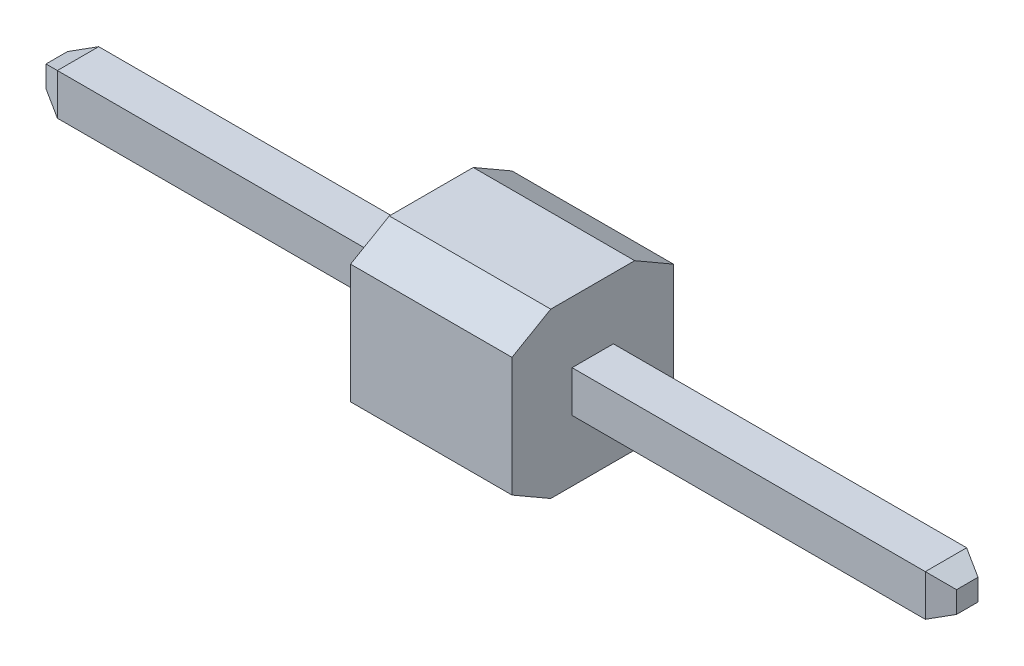
ISO-10303-21;
HEADER;
FILE_DESCRIPTION(('STEP AP214'),'2;1');
FILE_NAME('part.step','',(''),(''),'','','');
FILE_SCHEMA(('AUTOMOTIVE_DESIGN { 1 0 10303 214 1 1 1 1 }'));
ENDSEC;
DATA;
#1=APPLICATION_CONTEXT('core data for automotive mechanical design processes');
#2=APPLICATION_PROTOCOL_DEFINITION('international standard','automotive_design',2000,#1);
#3=PRODUCT_CONTEXT('',#1,'mechanical');
#4=PRODUCT('Part','Part','',(#3));
#5=PRODUCT_RELATED_PRODUCT_CATEGORY('part','',(#4));
#6=PRODUCT_DEFINITION_FORMATION('','',#4);
#7=PRODUCT_DEFINITION_CONTEXT('part definition',#1,'design');
#8=PRODUCT_DEFINITION('design','',#6,#7);
#9=PRODUCT_DEFINITION_SHAPE('','',#8);
#10=(LENGTH_UNIT() NAMED_UNIT(*) SI_UNIT(.MILLI.,.METRE.));
#11=(NAMED_UNIT(*) PLANE_ANGLE_UNIT() SI_UNIT($,.RADIAN.));
#12=(NAMED_UNIT(*) SI_UNIT($,.STERADIAN.) SOLID_ANGLE_UNIT());
#13=UNCERTAINTY_MEASURE_WITH_UNIT(LENGTH_MEASURE(1.E-05),#10,'distance_accuracy_value','');
#14=(GEOMETRIC_REPRESENTATION_CONTEXT(3) GLOBAL_UNCERTAINTY_ASSIGNED_CONTEXT((#13)) GLOBAL_UNIT_ASSIGNED_CONTEXT((#10,
#11,#12)) REPRESENTATION_CONTEXT('',''));
#15=CARTESIAN_POINT('',(0.,0.,0.));
#16=DIRECTION('',(0.,0.,1.));
#17=DIRECTION('',(1.,0.,0.));
#18=AXIS2_PLACEMENT_3D('',#15,#16,#17);
#19=CARTESIAN_POINT('',(5.4211019617172,15.5571157260571,-2.77112192788788));
#20=DIRECTION('',(1.,-9.93476518829084E-08,4.37113882867379E-08));
#21=DIRECTION('',(-9.93476589883358E-08,-1.,8.74227765734759E-08));
#22=AXIS2_PLACEMENT_3D('',#19,#20,#21);
#23=PLANE('',#22);
#24=DIRECTION('',(-1.18186632779336E-08,-0.500000075710541,-0.866025360072933));
#25=VECTOR('',#24,1.);
#26=CARTESIAN_POINT('',(5.42110176954259,14.3135260248209,-1.2011218191698));
#27=LINE('',#26,#25);
#28=CARTESIAN_POINT('',(5.42110176954259,14.3135260248209,-1.2011218191698));
#29=VERTEX_POINT('',#28);
#30=CARTESIAN_POINT('',(5.42110176135438,13.9671158108572,-1.80112178888567));
#31=VERTEX_POINT('',#30);
#32=EDGE_CURVE('E11',#29,#31,#27,.T.);
#33=ORIENTED_EDGE('',*,*,#32,.T.);
#34=DIRECTION('',(4.37113811813104E-08,-8.74227842254741E-08,-0.999999999999995));
#35=VECTOR('',#34,1.);
#36=CARTESIAN_POINT('',(5.42110176135438,13.9671158108572,-1.80112178888567));
#37=LINE('',#36,#35);
#38=CARTESIAN_POINT('',(5.42110181817917,13.9671156972076,-3.10112178888567));
#39=VERTEX_POINT('',#38);
#40=EDGE_CURVE('E304',#31,#39,#37,.T.);
#41=ORIENTED_EDGE('',*,*,#40,.T.);
#42=DIRECTION('',(8.75289963531795E-08,0.499999924289839,-0.866025447495711));
#43=VECTOR('',#42,1.);
#44=CARTESIAN_POINT('',(5.42110181817917,13.9671156972076,-3.10112178888567));
#45=LINE('',#44,#43);
#46=CARTESIAN_POINT('',(5.42110187882104,14.313525806264,-3.7011218191698));
#47=VERTEX_POINT('',#46);
#48=EDGE_CURVE('E296',#39,#47,#45,.T.);
#49=ORIENTED_EDGE('',*,*,#48,.T.);
#50=DIRECTION('',(9.93476588436476E-08,0.999999999999991,-8.74227767226933E-08));
#51=VECTOR('',#50,1.);
#52=CARTESIAN_POINT('',(5.42110187882104,14.313525806264,-3.7011218191698));
#53=LINE('',#52,#51);
#54=CARTESIAN_POINT('',(5.42110206233402,16.160705483234,-3.70112198065538));
#55=VERTEX_POINT('',#54);
#56=EDGE_CURVE('E281',#47,#55,#53,.T.);
#57=ORIENTED_EDGE('',*,*,#56,.T.);
#58=DIRECTION('',(-1.18186619958731E-08,-0.500000075710537,-0.866025360072935));
#59=VECTOR('',#58,1.);
#60=CARTESIAN_POINT('',(5.42110207052223,16.5071156972076,-3.10112201093952));
#61=LINE('',#60,#59);
#62=CARTESIAN_POINT('',(5.42110207052223,16.5071156972076,-3.10112201093952));
#63=VERTEX_POINT('',#62);
#64=EDGE_CURVE('E265',#63,#55,#61,.T.);
#65=ORIENTED_EDGE('',*,*,#64,.F.);
#66=DIRECTION('',(4.37113811813104E-08,-8.74227842254741E-08,-0.999999999999995));
#67=VECTOR('',#66,1.);
#68=CARTESIAN_POINT('',(5.42110201369743,16.5071158108572,-1.80112201093952));
#69=LINE('',#68,#67);
#70=CARTESIAN_POINT('',(5.42110201369743,16.5071158108572,-1.80112201093952));
#71=VERTEX_POINT('',#70);
#72=EDGE_CURVE('E248',#71,#63,#69,.T.);
#73=ORIENTED_EDGE('',*,*,#72,.F.);
#74=DIRECTION('',(8.7528996352548E-08,0.499999924289832,-0.866025447495716));
#75=VECTOR('',#74,1.);
#76=CARTESIAN_POINT('',(5.42110195305556,16.1607057017909,-1.20112198065538));
#77=LINE('',#76,#75);
#78=CARTESIAN_POINT('',(5.42110195305556,16.1607057017909,-1.20112198065538));
#79=VERTEX_POINT('',#78);
#80=EDGE_CURVE('E242',#79,#71,#77,.T.);
#81=ORIENTED_EDGE('',*,*,#80,.F.);
#82=DIRECTION('',(9.93476588436476E-08,0.999999999999991,-8.74227762418639E-08));
#83=VECTOR('',#82,1.);
#84=CARTESIAN_POINT('',(5.42110176954259,14.3135260248209,-1.2011218191698));
#85=LINE('',#84,#83);
#86=EDGE_CURVE('E236',#29,#79,#85,.T.);
#87=ORIENTED_EDGE('',*,*,#86,.F.);
#88=EDGE_LOOP('',(#33,#41,#49,#57,#65,#73,#81,#87));
#89=FACE_BOUND('',#88,.T.);
#90=DIRECTION('',(-4.37113817364219E-08,8.74227856773042E-08,0.999999999999995));
#91=VECTOR('',#90,1.);
#92=CARTESIAN_POINT('',(5.42110189813469,14.9171157260571,-2.7711218719373));
#93=LINE('',#92,#91);
#94=CARTESIAN_POINT('',(5.42110189813469,14.9171157260571,-2.7711218719373));
#95=VERTEX_POINT('',#94);
#96=CARTESIAN_POINT('',(5.42110187015941,14.9171157820077,-2.1311218719373));
#97=VERTEX_POINT('',#96);
#98=EDGE_CURVE('E302',#95,#97,#93,.T.);
#99=ORIENTED_EDGE('',*,*,#98,.T.);
#100=DIRECTION('',(-9.93476592658906E-08,-0.999999999999991,8.74227766567418E-08));
#101=VECTOR('',#100,1.);
#102=CARTESIAN_POINT('',(5.42110193374191,15.5571157820077,-2.13112192788788));
#103=LINE('',#102,#101);
#104=CARTESIAN_POINT('',(5.42110193374191,15.5571157820077,-2.13112192788788));
#105=VERTEX_POINT('',#104);
#106=EDGE_CURVE('E293',#105,#97,#103,.T.);
#107=ORIENTED_EDGE('',*,*,#106,.F.);
#108=DIRECTION('',(-4.37113817364219E-08,8.74227912284194E-08,0.999999999999995));
#109=VECTOR('',#108,1.);
#110=CARTESIAN_POINT('',(5.4211019617172,15.5571157260571,-2.77112192788788));
#111=LINE('',#110,#109);
#112=CARTESIAN_POINT('',(5.4211019617172,15.5571157260571,-2.77112192788788));
#113=VERTEX_POINT('',#112);
#114=EDGE_CURVE('E278',#113,#105,#111,.T.);
#115=ORIENTED_EDGE('',*,*,#114,.F.);
#116=DIRECTION('',(-9.93476592658906E-08,-0.999999999999991,8.74227759628524E-08));
#117=VECTOR('',#116,1.);
#118=CARTESIAN_POINT('',(5.4211019617172,15.5571157260571,-2.77112192788788));
#119=LINE('',#118,#117);
#120=EDGE_CURVE('E263',#113,#95,#119,.T.);
#121=ORIENTED_EDGE('',*,*,#120,.T.);
#122=EDGE_LOOP('',(#99,#107,#115,#121));
#123=FACE_BOUND('',#122,.T.);
#124=ADVANCED_FACE('F17',(#89,#123),#23,.T.);
#125=CARTESIAN_POINT('',(2.9211019617172,15.5571159744263,-2.77112203716635));
#126=DIRECTION('',(1.,-9.93476518829084E-08,4.37113882867379E-08));
#127=DIRECTION('',(-9.93476589883358E-08,-1.,8.74227765734759E-08));
#128=AXIS2_PLACEMENT_3D('',#125,#126,#127);
#129=PLANE('',#128);
#130=DIRECTION('',(-1.18186632779336E-08,-0.500000075710541,-0.866025360072933));
#131=VECTOR('',#130,1.);
#132=CARTESIAN_POINT('',(2.92110176954259,14.31352627319,-1.20112192844828));
#133=LINE('',#132,#131);
#134=CARTESIAN_POINT('',(2.92110176954259,14.31352627319,-1.20112192844828));
#135=VERTEX_POINT('',#134);
#136=CARTESIAN_POINT('',(2.92110176135438,13.9671160592264,-1.80112189816414));
#137=VERTEX_POINT('',#136);
#138=EDGE_CURVE('E24',#135,#137,#133,.T.);
#139=ORIENTED_EDGE('',*,*,#138,.F.);
#140=DIRECTION('',(9.93476588436476E-08,0.999999999999991,-8.74227762418639E-08));
#141=VECTOR('',#140,1.);
#142=CARTESIAN_POINT('',(2.92110176954259,14.31352627319,-1.20112192844828));
#143=LINE('',#142,#141);
#144=CARTESIAN_POINT('',(2.92110195305556,16.16070595016,-1.20112208993385));
#145=VERTEX_POINT('',#144);
#146=EDGE_CURVE('E300',#135,#145,#143,.T.);
#147=ORIENTED_EDGE('',*,*,#146,.T.);
#148=DIRECTION('',(8.7528996352548E-08,0.499999924289832,-0.866025447495716));
#149=VECTOR('',#148,1.);
#150=CARTESIAN_POINT('',(2.92110195305556,16.16070595016,-1.20112208993385));
#151=LINE('',#150,#149);
#152=CARTESIAN_POINT('',(2.92110201369743,16.5071160592264,-1.80112212021799));
#153=VERTEX_POINT('',#152);
#154=EDGE_CURVE('E286',#145,#153,#151,.T.);
#155=ORIENTED_EDGE('',*,*,#154,.T.);
#156=DIRECTION('',(4.37113811813104E-08,-8.74227842254741E-08,-0.999999999999995));
#157=VECTOR('',#156,1.);
#158=CARTESIAN_POINT('',(2.92110201369743,16.5071160592264,-1.80112212021799));
#159=LINE('',#158,#157);
#160=CARTESIAN_POINT('',(2.92110207052223,16.5071159455768,-3.10112212021799));
#161=VERTEX_POINT('',#160);
#162=EDGE_CURVE('E271',#153,#161,#159,.T.);
#163=ORIENTED_EDGE('',*,*,#162,.T.);
#164=DIRECTION('',(-1.18186626368607E-08,-0.500000075710537,-0.866025360072935));
#165=VECTOR('',#164,1.);
#166=CARTESIAN_POINT('',(2.92110207052223,16.5071159455768,-3.10112212021799));
#167=LINE('',#166,#165);
#168=CARTESIAN_POINT('',(2.92110206233402,16.1607057316031,-3.70112208993385));
#169=VERTEX_POINT('',#168);
#170=EDGE_CURVE('E253',#161,#169,#167,.T.);
#171=ORIENTED_EDGE('',*,*,#170,.T.);
#172=DIRECTION('',(9.93476588436476E-08,0.999999999999991,-8.74227767226933E-08));
#173=VECTOR('',#172,1.);
#174=CARTESIAN_POINT('',(2.92110187882104,14.3135260546331,-3.70112192844828));
#175=LINE('',#174,#173);
#176=CARTESIAN_POINT('',(2.92110187882104,14.3135260546331,-3.70112192844828));
#177=VERTEX_POINT('',#176);
#178=EDGE_CURVE('E261',#177,#169,#175,.T.);
#179=ORIENTED_EDGE('',*,*,#178,.F.);
#180=DIRECTION('',(8.75289963531795E-08,0.499999924289839,-0.866025447495711));
#181=VECTOR('',#180,1.);
#182=CARTESIAN_POINT('',(2.92110181817917,13.9671159455768,-3.10112189816414));
#183=LINE('',#182,#181);
#184=CARTESIAN_POINT('',(2.92110181817917,13.9671159455768,-3.10112189816414));
#185=VERTEX_POINT('',#184);
#186=EDGE_CURVE('E276',#185,#177,#183,.T.);
#187=ORIENTED_EDGE('',*,*,#186,.F.);
#188=DIRECTION('',(4.37113811813104E-08,-8.74227842254741E-08,-0.999999999999995));
#189=VECTOR('',#188,1.);
#190=CARTESIAN_POINT('',(2.92110176135438,13.9671160592264,-1.80112189816414));
#191=LINE('',#190,#189);
#192=EDGE_CURVE('E291',#137,#185,#191,.T.);
#193=ORIENTED_EDGE('',*,*,#192,.F.);
#194=EDGE_LOOP('',(#139,#147,#155,#163,#171,#179,#187,#193));
#195=FACE_BOUND('',#194,.T.);
#196=DIRECTION('',(-9.93476585720012E-08,-0.999999999999991,8.74227766567418E-08));
#197=VECTOR('',#196,1.);
#198=CARTESIAN_POINT('',(2.92110193374191,15.5571160303769,-2.13112203716635));
#199=LINE('',#198,#197);
#200=CARTESIAN_POINT('',(2.92110193374191,15.5571160303769,-2.13112203716635));
#201=VERTEX_POINT('',#200);
#202=CARTESIAN_POINT('',(2.92110187015941,14.9171160303769,-2.13112198121578));
#203=VERTEX_POINT('',#202);
#204=EDGE_CURVE('E298',#201,#203,#199,.T.);
#205=ORIENTED_EDGE('',*,*,#204,.T.);
#206=DIRECTION('',(-4.37113810425325E-08,8.74227856773042E-08,0.999999999999995));
#207=VECTOR('',#206,1.);
#208=CARTESIAN_POINT('',(2.92110189813469,14.9171159744263,-2.77112198121578));
#209=LINE('',#208,#207);
#210=CARTESIAN_POINT('',(2.92110189813469,14.9171159744263,-2.77112198121578));
#211=VERTEX_POINT('',#210);
#212=EDGE_CURVE('E283',#211,#203,#209,.T.);
#213=ORIENTED_EDGE('',*,*,#212,.F.);
#214=DIRECTION('',(-9.93476592658906E-08,-0.999999999999991,8.74227759628524E-08));
#215=VECTOR('',#214,1.);
#216=CARTESIAN_POINT('',(2.9211019617172,15.5571159744263,-2.77112203716635));
#217=LINE('',#216,#215);
#218=CARTESIAN_POINT('',(2.9211019617172,15.5571159744263,-2.77112203716635));
#219=VERTEX_POINT('',#218);
#220=EDGE_CURVE('E268',#219,#211,#217,.T.);
#221=ORIENTED_EDGE('',*,*,#220,.F.);
#222=DIRECTION('',(-4.37113817364219E-08,8.74227912284194E-08,0.999999999999995));
#223=VECTOR('',#222,1.);
#224=CARTESIAN_POINT('',(2.9211019617172,15.5571159744263,-2.77112203716635));
#225=LINE('',#224,#223);
#226=EDGE_CURVE('E251',#219,#201,#225,.T.);
#227=ORIENTED_EDGE('',*,*,#226,.T.);
#228=EDGE_LOOP('',(#205,#213,#221,#227));
#229=FACE_BOUND('',#228,.T.);
#230=ADVANCED_FACE('F314',(#195,#229),#129,.F.);
#231=CARTESIAN_POINT('',(5.42110176954259,14.3135260248209,-1.2011218191698));
#232=DIRECTION('',(1.07893287081065E-07,0.866025360072937,-0.500000075710535));
#233=DIRECTION('',(1.18186629566715E-08,0.500000075710542,0.866025360072941));
#234=AXIS2_PLACEMENT_3D('',#231,#232,#233);
#235=PLANE('',#234);
#236=ORIENTED_EDGE('',*,*,#138,.T.);
#237=DIRECTION('',(-0.999999999999994,9.93476490407369E-08,-4.37113882867377E-08));
#238=VECTOR('',#237,1.);
#239=CARTESIAN_POINT('',(5.42110176135438,13.9671158108572,-1.80112178888567));
#240=LINE('',#239,#238);
#241=EDGE_CURVE('E288',#31,#137,#240,.T.);
#242=ORIENTED_EDGE('',*,*,#241,.F.);
#243=ORIENTED_EDGE('',*,*,#32,.F.);
#244=DIRECTION('',(-0.999999999999994,9.93476533039933E-08,-4.3711388109102E-08));
#245=VECTOR('',#244,1.);
#246=CARTESIAN_POINT('',(5.42110176954259,14.3135260248209,-1.2011218191698));
#247=LINE('',#246,#245);
#248=EDGE_CURVE('E256',#29,#135,#247,.T.);
#249=ORIENTED_EDGE('',*,*,#248,.T.);
#250=EDGE_LOOP('',(#236,#242,#243,#249));
#251=FACE_BOUND('',#250,.T.);
#252=ADVANCED_FACE('F306',(#251),#235,.F.);
#253=CARTESIAN_POINT('',(5.42110176135438,13.9671158108572,-1.80112178888567));
#254=DIRECTION('',(9.93476589883358E-08,1.,-8.74227765734759E-08));
#255=DIRECTION('',(1.,-9.93476518829084E-08,4.37113882867379E-08));
#256=AXIS2_PLACEMENT_3D('',#253,#254,#255);
#257=PLANE('',#256);
#258=ORIENTED_EDGE('',*,*,#192,.T.);
#259=DIRECTION('',(-0.999999999999994,9.93476490407369E-08,-4.37113882867377E-08));
#260=VECTOR('',#259,1.);
#261=CARTESIAN_POINT('',(5.42110181817917,13.9671156972076,-3.10112178888567));
#262=LINE('',#261,#260);
#263=EDGE_CURVE('E273',#39,#185,#262,.T.);
#264=ORIENTED_EDGE('',*,*,#263,.F.);
#265=ORIENTED_EDGE('',*,*,#40,.F.);
#266=ORIENTED_EDGE('',*,*,#241,.T.);
#267=EDGE_LOOP('',(#258,#264,#265,#266));
#268=FACE_BOUND('',#267,.T.);
#269=ADVANCED_FACE('F311',(#268),#257,.F.);
#270=CARTESIAN_POINT('',(5.42110181817917,13.9671156972076,-3.10112178888567));
#271=DIRECTION('',(6.41819058997377E-08,0.866025447495721,0.499999924289845));
#272=DIRECTION('',(-8.7528996031702E-08,-0.499999924289838,0.866025447495717));
#273=AXIS2_PLACEMENT_3D('',#270,#271,#272);
#274=PLANE('',#273);
#275=ORIENTED_EDGE('',*,*,#186,.T.);
#276=DIRECTION('',(-0.999999999999994,9.93476533039933E-08,-4.37113884643734E-08));
#277=VECTOR('',#276,1.);
#278=CARTESIAN_POINT('',(5.42110187882104,14.313525806264,-3.7011218191698));
#279=LINE('',#278,#277);
#280=EDGE_CURVE('E258',#47,#177,#279,.T.);
#281=ORIENTED_EDGE('',*,*,#280,.F.);
#282=ORIENTED_EDGE('',*,*,#48,.F.);
#283=ORIENTED_EDGE('',*,*,#263,.T.);
#284=EDGE_LOOP('',(#275,#281,#282,#283));
#285=FACE_BOUND('',#284,.T.);
#286=ADVANCED_FACE('F319',(#285),#274,.F.);
#287=CARTESIAN_POINT('',(5.42110187882104,14.313525806264,-3.7011218191698));
#288=DIRECTION('',(-4.37113811813106E-08,8.74227836789032E-08,1.));
#289=DIRECTION('',(-1.,9.93476518829084E-08,-4.37113882867379E-08));
#290=AXIS2_PLACEMENT_3D('',#287,#288,#289);
#291=PLANE('',#290);
#292=ORIENTED_EDGE('',*,*,#178,.T.);
#293=DIRECTION('',(-0.999999999999994,9.93476533039933E-08,-4.37113882867377E-08));
#294=VECTOR('',#293,1.);
#295=CARTESIAN_POINT('',(5.42110206233402,16.160705483234,-3.70112198065538));
#296=LINE('',#295,#294);
#297=EDGE_CURVE('E245',#55,#169,#296,.T.);
#298=ORIENTED_EDGE('',*,*,#297,.F.);
#299=ORIENTED_EDGE('',*,*,#56,.F.);
#300=ORIENTED_EDGE('',*,*,#280,.T.);
#301=EDGE_LOOP('',(#292,#298,#299,#300));
#302=FACE_BOUND('',#301,.T.);
#303=ADVANCED_FACE('F326',(#302),#291,.F.);
#304=CARTESIAN_POINT('',(5.42110207052223,16.5071156972076,-3.10112201093952));
#305=DIRECTION('',(1.07893287081065E-07,0.866025360072937,-0.500000075710535));
#306=DIRECTION('',(1.18186629566715E-08,0.500000075710542,0.866025360072941));
#307=AXIS2_PLACEMENT_3D('',#304,#305,#306);
#308=PLANE('',#307);
#309=ORIENTED_EDGE('',*,*,#170,.F.);
#310=DIRECTION('',(-0.999999999999994,9.93476490407369E-08,-4.37113882867377E-08));
#311=VECTOR('',#310,1.);
#312=CARTESIAN_POINT('',(5.42110207052223,16.5071156972076,-3.10112201093952));
#313=LINE('',#312,#311);
#314=EDGE_CURVE('E239',#63,#161,#313,.T.);
#315=ORIENTED_EDGE('',*,*,#314,.F.);
#316=ORIENTED_EDGE('',*,*,#64,.T.);
#317=ORIENTED_EDGE('',*,*,#297,.T.);
#318=EDGE_LOOP('',(#309,#315,#316,#317));
#319=FACE_BOUND('',#318,.T.);
#320=ADVANCED_FACE('F329',(#319),#308,.T.);
#321=CARTESIAN_POINT('',(5.42110201369743,16.5071158108572,-1.80112201093952));
#322=DIRECTION('',(9.93476589883358E-08,1.,-8.74227765734759E-08));
#323=DIRECTION('',(1.,-9.93476518829084E-08,4.37113882867379E-08));
#324=AXIS2_PLACEMENT_3D('',#321,#322,#323);
#325=PLANE('',#324);
#326=ORIENTED_EDGE('',*,*,#162,.F.);
#327=DIRECTION('',(-0.999999999999994,9.93476490407369E-08,-4.37113883755555E-08));
#328=VECTOR('',#327,1.);
#329=CARTESIAN_POINT('',(5.42110201369743,16.5071158108572,-1.80112201093952));
#330=LINE('',#329,#328);
#331=EDGE_CURVE('E233',#71,#153,#330,.T.);
#332=ORIENTED_EDGE('',*,*,#331,.F.);
#333=ORIENTED_EDGE('',*,*,#72,.T.);
#334=ORIENTED_EDGE('',*,*,#314,.T.);
#335=EDGE_LOOP('',(#326,#332,#333,#334));
#336=FACE_BOUND('',#335,.T.);
#337=ADVANCED_FACE('F333',(#336),#325,.T.);
#338=CARTESIAN_POINT('',(5.42110195305556,16.1607057017909,-1.20112198065538));
#339=DIRECTION('',(6.41819058997377E-08,0.866025447495721,0.499999924289845));
#340=DIRECTION('',(-8.7528996031702E-08,-0.499999924289838,0.866025447495717));
#341=AXIS2_PLACEMENT_3D('',#338,#339,#340);
#342=PLANE('',#341);
#343=ORIENTED_EDGE('',*,*,#154,.F.);
#344=DIRECTION('',(-0.999999999999994,9.93476533039933E-08,-4.3711388109102E-08));
#345=VECTOR('',#344,1.);
#346=CARTESIAN_POINT('',(5.42110195305556,16.1607057017909,-1.20112198065538));
#347=LINE('',#346,#345);
#348=EDGE_CURVE('E230',#79,#145,#347,.T.);
#349=ORIENTED_EDGE('',*,*,#348,.F.);
#350=ORIENTED_EDGE('',*,*,#80,.T.);
#351=ORIENTED_EDGE('',*,*,#331,.T.);
#352=EDGE_LOOP('',(#343,#349,#350,#351));
#353=FACE_BOUND('',#352,.T.);
#354=ADVANCED_FACE('F337',(#353),#342,.T.);
#355=CARTESIAN_POINT('',(5.42110176954259,14.3135260248209,-1.2011218191698));
#356=DIRECTION('',(-4.37113811813106E-08,8.74227835615132E-08,1.));
#357=DIRECTION('',(-9.93476589883358E-08,-1.,8.74227764560859E-08));
#358=AXIS2_PLACEMENT_3D('',#355,#356,#357);
#359=PLANE('',#358);
#360=ORIENTED_EDGE('',*,*,#146,.F.);
#361=ORIENTED_EDGE('',*,*,#248,.F.);
#362=ORIENTED_EDGE('',*,*,#86,.T.);
#363=ORIENTED_EDGE('',*,*,#348,.T.);
#364=EDGE_LOOP('',(#360,#361,#362,#363));
#365=FACE_BOUND('',#364,.T.);
#366=ADVANCED_FACE('F339',(#365),#359,.T.);
#367=CARTESIAN_POINT('',(-2.8788980382828,15.5571165506427,-2.7711222906924));
#368=DIRECTION('',(-1.,9.93476518829084E-08,-4.37113882867379E-08));
#369=DIRECTION('',(9.93476589883358E-08,1.,-8.74227765734759E-08));
#370=AXIS2_PLACEMENT_3D('',#367,#368,#369);
#371=PLANE('',#370);
#372=DIRECTION('',(9.93476554744636E-08,0.999999999999991,-8.7422776141512E-08));
#373=VECTOR('',#372,1.);
#374=CARTESIAN_POINT('',(-2.87889810782645,15.0709981203305,-2.28500377538558));
#375=LINE('',#374,#373);
#376=CARTESIAN_POINT('',(-2.87889810782645,15.0709981203305,-2.28500377538558));
#377=VERTEX_POINT('',#376);
#378=CARTESIAN_POINT('',(-2.87889807481948,15.4032350659405,-2.28500380443065));
#379=VERTEX_POINT('',#378);
#380=EDGE_CURVE('E228',#377,#379,#375,.T.);
#381=ORIENTED_EDGE('',*,*,#380,.T.);
#382=DIRECTION('',(4.37113820547149E-08,-8.74227854960561E-08,-0.999999999999995));
#383=VECTOR('',#382,1.);
#384=CARTESIAN_POINT('',(-2.87889807481948,15.4032350659405,-2.28500380443065));
#385=LINE('',#384,#383);
#386=CARTESIAN_POINT('',(-2.87889806029695,15.4032350368954,-2.61724075004865));
#387=VERTEX_POINT('',#386);
#388=EDGE_CURVE('E223',#379,#387,#385,.T.);
#389=ORIENTED_EDGE('',*,*,#388,.T.);
#390=DIRECTION('',(-9.93476581477919E-08,-0.999999999999991,8.7422776141512E-08));
#391=VECTOR('',#390,1.);
#392=CARTESIAN_POINT('',(-2.87889806029695,15.4032350368954,-2.61724075004865));
#393=LINE('',#392,#391);
#394=CARTESIAN_POINT('',(-2.87889809330391,15.0709980912854,-2.61724072100358));
#395=VERTEX_POINT('',#394);
#396=EDGE_CURVE('E215',#387,#395,#393,.T.);
#397=ORIENTED_EDGE('',*,*,#396,.T.);
#398=DIRECTION('',(-4.37113740347301E-08,8.74227641094299E-08,0.999999999999995));
#399=VECTOR('',#398,1.);
#400=CARTESIAN_POINT('',(-2.87889809330391,15.0709980912854,-2.61724072100358));
#401=LINE('',#400,#399);
#402=EDGE_CURVE('E207',#395,#377,#401,.T.);
#403=ORIENTED_EDGE('',*,*,#402,.T.);
#404=EDGE_LOOP('',(#381,#389,#397,#403));
#405=FACE_BOUND('',#404,.T.);
#406=ADVANCED_FACE('F341',(#405),#371,.T.);
#407=CARTESIAN_POINT('',(-2.8788980382828,15.5571165506427,-2.7711222906924));
#408=DIRECTION('',(9.93476589883358E-08,1.,-8.74227764510112E-08));
#409=DIRECTION('',(-4.37113811813106E-08,8.74227835564385E-08,1.));
#410=AXIS2_PLACEMENT_3D('',#407,#408,#409);
#411=PLANE('',#410);
#412=DIRECTION('',(0.999999999999994,-9.93476527532252E-08,4.37113883581816E-08));
#413=VECTOR('',#412,1.);
#414=CARTESIAN_POINT('',(-2.5488980382828,15.5571165178579,-2.77112227626765));
#415=LINE('',#414,#413);
#416=CARTESIAN_POINT('',(-2.5488980382828,15.5571165178579,-2.77112227626765));
#417=VERTEX_POINT('',#416);
#418=EDGE_CURVE('E225',#417,#219,#415,.T.);
#419=ORIENTED_EDGE('',*,*,#418,.F.);
#420=DIRECTION('',(-4.37113817364219E-08,8.74227912284193E-08,0.999999999999995));
#421=VECTOR('',#420,1.);
#422=CARTESIAN_POINT('',(-2.5488980382828,15.5571165178579,-2.77112227626765));
#423=LINE('',#422,#421);
#424=CARTESIAN_POINT('',(-2.54889806625809,15.5571165738085,-2.13112227626765));
#425=VERTEX_POINT('',#424);
#426=EDGE_CURVE('E217',#417,#425,#423,.T.);
#427=ORIENTED_EDGE('',*,*,#426,.T.);
#428=DIRECTION('',(0.999999999999994,-9.93476527532252E-08,4.37113882769953E-08));
#429=VECTOR('',#428,1.);
#430=CARTESIAN_POINT('',(-2.54889806625809,15.5571165738085,-2.13112227626765));
#431=LINE('',#430,#429);
#432=EDGE_CURVE('E220',#425,#201,#431,.T.);
#433=ORIENTED_EDGE('',*,*,#432,.T.);
#434=ORIENTED_EDGE('',*,*,#226,.F.);
#435=EDGE_LOOP('',(#419,#427,#433,#434));
#436=FACE_BOUND('',#435,.T.);
#437=ADVANCED_FACE('F348',(#436),#411,.T.);
#438=CARTESIAN_POINT('',(-2.87889806625809,15.5571166065932,-2.1311222906924));
#439=DIRECTION('',(-4.37113811813106E-08,8.74227836789032E-08,1.));
#440=DIRECTION('',(-1.,9.93476518829084E-08,-4.37113882867379E-08));
#441=AXIS2_PLACEMENT_3D('',#438,#439,#440);
#442=PLANE('',#441);
#443=ORIENTED_EDGE('',*,*,#432,.F.);
#444=DIRECTION('',(-9.93476592658906E-08,-0.999999999999991,8.74227766567418E-08));
#445=VECTOR('',#444,1.);
#446=CARTESIAN_POINT('',(-2.54889806625809,15.5571165738085,-2.13112227626765));
#447=LINE('',#446,#445);
#448=CARTESIAN_POINT('',(-2.54889812984059,14.9171165738085,-2.13112222031707));
#449=VERTEX_POINT('',#448);
#450=EDGE_CURVE('E209',#425,#449,#447,.T.);
#451=ORIENTED_EDGE('',*,*,#450,.T.);
#452=DIRECTION('',(0.999999999999994,-9.93476495057721E-08,4.3711388195809E-08));
#453=VECTOR('',#452,1.);
#454=CARTESIAN_POINT('',(-2.54889812984059,14.9171165738085,-2.13112222031707));
#455=LINE('',#454,#453);
#456=EDGE_CURVE('E212',#449,#203,#455,.T.);
#457=ORIENTED_EDGE('',*,*,#456,.T.);
#458=ORIENTED_EDGE('',*,*,#204,.F.);
#459=EDGE_LOOP('',(#443,#451,#457,#458));
#460=FACE_BOUND('',#459,.T.);
#461=ADVANCED_FACE('F424',(#460),#442,.T.);
#462=CARTESIAN_POINT('',(-2.87889810186531,14.9171165506427,-2.77112223474183));
#463=DIRECTION('',(9.93476589883357E-08,1.,-8.74227764040693E-08));
#464=DIRECTION('',(-4.37113811813106E-08,8.74227835094966E-08,1.));
#465=AXIS2_PLACEMENT_3D('',#462,#463,#464);
#466=PLANE('',#465);
#467=ORIENTED_EDGE('',*,*,#456,.F.);
#468=DIRECTION('',(4.37113831242006E-08,-8.74227912284193E-08,-0.999999999999995));
#469=VECTOR('',#468,1.);
#470=CARTESIAN_POINT('',(-2.54889812984059,14.9171165738085,-2.13112222031707));
#471=LINE('',#470,#469);
#472=CARTESIAN_POINT('',(-2.54889810186531,14.9171165178579,-2.77112222031707));
#473=VERTEX_POINT('',#472);
#474=EDGE_CURVE('E201',#449,#473,#471,.T.);
#475=ORIENTED_EDGE('',*,*,#474,.T.);
#476=DIRECTION('',(0.999999999999994,-9.93476495057722E-08,4.37113882769953E-08));
#477=VECTOR('',#476,1.);
#478=CARTESIAN_POINT('',(-2.54889810186531,14.9171165178579,-2.77112222031707));
#479=LINE('',#478,#477);
#480=EDGE_CURVE('E204',#473,#211,#479,.T.);
#481=ORIENTED_EDGE('',*,*,#480,.T.);
#482=ORIENTED_EDGE('',*,*,#212,.T.);
#483=EDGE_LOOP('',(#467,#475,#481,#482));
#484=FACE_BOUND('',#483,.T.);
#485=ADVANCED_FACE('F421',(#484),#466,.F.);
#486=CARTESIAN_POINT('',(-2.8788980382828,15.5571165506427,-2.7711222906924));
#487=DIRECTION('',(-4.37113811813106E-08,8.74227836789032E-08,1.));
#488=DIRECTION('',(-1.,9.93476518829084E-08,-4.37113882867379E-08));
#489=AXIS2_PLACEMENT_3D('',#486,#487,#488);
#490=PLANE('',#489);
#491=ORIENTED_EDGE('',*,*,#480,.F.);
#492=DIRECTION('',(9.93476578781118E-08,0.999999999999991,-8.74227766567418E-08));
#493=VECTOR('',#492,1.);
#494=CARTESIAN_POINT('',(-2.54889810186531,14.9171165178579,-2.77112222031707));
#495=LINE('',#494,#493);
#496=EDGE_CURVE('E196',#473,#417,#495,.T.);
#497=ORIENTED_EDGE('',*,*,#496,.T.);
#498=ORIENTED_EDGE('',*,*,#418,.T.);
#499=ORIENTED_EDGE('',*,*,#220,.T.);
#500=EDGE_LOOP('',(#491,#497,#498,#499));
#501=FACE_BOUND('',#500,.T.);
#502=ADVANCED_FACE('F376',(#501),#490,.F.);
#503=CARTESIAN_POINT('',(-2.8788980382828,15.5571165506427,-2.7711222906924));
#504=DIRECTION('',(-4.37113811813106E-08,8.74227836789032E-08,1.));
#505=DIRECTION('',(-1.,9.93476518829084E-08,-4.37113882867379E-08));
#506=AXIS2_PLACEMENT_3D('',#503,#504,#505);
#507=PLANE('',#506);
#508=DIRECTION('',(0.999999999999994,-9.93476469078097E-08,4.37113882769953E-08));
#509=VECTOR('',#508,1.);
#510=CARTESIAN_POINT('',(5.4211019617172,15.5571157260572,-2.77112192788788));
#511=LINE('',#510,#509);
#512=CARTESIAN_POINT('',(10.8911019617172,15.5571151826255,-2.77112168878659));
#513=VERTEX_POINT('',#512);
#514=EDGE_CURVE('E199',#113,#513,#511,.T.);
#515=ORIENTED_EDGE('',*,*,#514,.T.);
#516=DIRECTION('',(-9.93476606536693E-08,-0.999999999999991,8.74227766567418E-08));
#517=VECTOR('',#516,1.);
#518=CARTESIAN_POINT('',(10.8911019617172,15.5571151826255,-2.77112168878659));
#519=LINE('',#518,#517);
#520=CARTESIAN_POINT('',(10.8911018981347,14.9171151826255,-2.77112163283601));
#521=VERTEX_POINT('',#520);
#522=EDGE_CURVE('E191',#513,#521,#519,.T.);
#523=ORIENTED_EDGE('',*,*,#522,.T.);
#524=DIRECTION('',(0.999999999999994,-9.93476521037346E-08,4.37113883581817E-08));
#525=VECTOR('',#524,1.);
#526=CARTESIAN_POINT('',(5.42110189813469,14.9171157260572,-2.7711218719373));
#527=LINE('',#526,#525);
#528=EDGE_CURVE('E194',#95,#521,#527,.T.);
#529=ORIENTED_EDGE('',*,*,#528,.F.);
#530=ORIENTED_EDGE('',*,*,#120,.F.);
#531=EDGE_LOOP('',(#515,#523,#529,#530));
#532=FACE_BOUND('',#531,.T.);
#533=ADVANCED_FACE('F367',(#532),#507,.F.);
#534=CARTESIAN_POINT('',(-2.87889810186531,14.9171165506427,-2.77112223474183));
#535=DIRECTION('',(9.93476589883357E-08,1.,-8.74227764040693E-08));
#536=DIRECTION('',(-4.37113811813106E-08,8.74227835094966E-08,1.));
#537=AXIS2_PLACEMENT_3D('',#534,#535,#536);
#538=PLANE('',#537);
#539=ORIENTED_EDGE('',*,*,#528,.T.);
#540=DIRECTION('',(-4.37113817364219E-08,8.74227856773043E-08,0.999999999999995));
#541=VECTOR('',#540,1.);
#542=CARTESIAN_POINT('',(10.8911018981347,14.9171151826255,-2.77112163283601));
#543=LINE('',#542,#541);
#544=CARTESIAN_POINT('',(10.8911018701594,14.9171152385761,-2.13112163283601));
#545=VERTEX_POINT('',#544);
#546=EDGE_CURVE('E186',#521,#545,#543,.T.);
#547=ORIENTED_EDGE('',*,*,#546,.T.);
#548=DIRECTION('',(0.999999999999994,-9.93476521037346E-08,4.3711388195809E-08));
#549=VECTOR('',#548,1.);
#550=CARTESIAN_POINT('',(5.42110187015941,14.9171157820077,-2.13112187193731));
#551=LINE('',#550,#549);
#552=EDGE_CURVE('E189',#97,#545,#551,.T.);
#553=ORIENTED_EDGE('',*,*,#552,.F.);
#554=ORIENTED_EDGE('',*,*,#98,.F.);
#555=EDGE_LOOP('',(#539,#547,#553,#554));
#556=FACE_BOUND('',#555,.T.);
#557=ADVANCED_FACE('F364',(#556),#538,.F.);
#558=CARTESIAN_POINT('',(-2.87889806625809,15.5571166065932,-2.1311222906924));
#559=DIRECTION('',(-4.37113811813106E-08,8.74227836789032E-08,1.));
#560=DIRECTION('',(-1.,9.93476518829084E-08,-4.37113882867379E-08));
#561=AXIS2_PLACEMENT_3D('',#558,#559,#560);
#562=PLANE('',#561);
#563=ORIENTED_EDGE('',*,*,#552,.T.);
#564=DIRECTION('',(9.93476578781118E-08,0.999999999999991,-8.74227766567418E-08));
#565=VECTOR('',#564,1.);
#566=CARTESIAN_POINT('',(10.8911018701594,14.9171152385761,-2.13112163283601));
#567=LINE('',#566,#565);
#568=CARTESIAN_POINT('',(10.8911019337419,15.5571152385761,-2.13112168878659));
#569=VERTEX_POINT('',#568);
#570=EDGE_CURVE('E176',#545,#569,#567,.T.);
#571=ORIENTED_EDGE('',*,*,#570,.T.);
#572=DIRECTION('',(0.999999999999994,-9.93476469078097E-08,4.37113880334363E-08));
#573=VECTOR('',#572,1.);
#574=CARTESIAN_POINT('',(5.42110193374191,15.5571157820077,-2.13112192788788));
#575=LINE('',#574,#573);
#576=EDGE_CURVE('E179',#105,#569,#575,.T.);
#577=ORIENTED_EDGE('',*,*,#576,.F.);
#578=ORIENTED_EDGE('',*,*,#106,.T.);
#579=EDGE_LOOP('',(#563,#571,#577,#578));
#580=FACE_BOUND('',#579,.T.);
#581=ADVANCED_FACE('F366',(#580),#562,.T.);
#582=CARTESIAN_POINT('',(-2.8788980382828,15.5571165506427,-2.7711222906924));
#583=DIRECTION('',(9.93476589883358E-08,1.,-8.74227764510112E-08));
#584=DIRECTION('',(-4.37113811813106E-08,8.74227835564385E-08,1.));
#585=AXIS2_PLACEMENT_3D('',#582,#583,#584);
#586=PLANE('',#585);
#587=ORIENTED_EDGE('',*,*,#576,.T.);
#588=DIRECTION('',(4.37113817364219E-08,-8.74227856773043E-08,-0.999999999999995));
#589=VECTOR('',#588,1.);
#590=CARTESIAN_POINT('',(10.8911019337419,15.5571152385761,-2.13112168878659));
#591=LINE('',#590,#589);
#592=EDGE_CURVE('E167',#569,#513,#591,.T.);
#593=ORIENTED_EDGE('',*,*,#592,.T.);
#594=ORIENTED_EDGE('',*,*,#514,.F.);
#595=ORIENTED_EDGE('',*,*,#114,.T.);
#596=EDGE_LOOP('',(#587,#593,#594,#595));
#597=FACE_BOUND('',#596,.T.);
#598=ADVANCED_FACE('F373',(#597),#586,.T.);
#599=CARTESIAN_POINT('',(11.2211019617172,15.5571151498408,-2.77112167436183));
#600=DIRECTION('',(-1.,9.93476518829084E-08,-4.37113882867379E-08));
#601=DIRECTION('',(9.93476589883358E-08,1.,-8.74227765734759E-08));
#602=AXIS2_PLACEMENT_3D('',#599,#600,#601);
#603=PLANE('',#602);
#604=DIRECTION('',(-9.93476581477919E-08,-0.999999999999991,8.74227774781761E-08));
#605=VECTOR('',#604,1.);
#606=CARTESIAN_POINT('',(11.2211019251805,15.4032336651386,-2.28500318810008));
#607=LINE('',#606,#605);
#608=CARTESIAN_POINT('',(11.2211019251805,15.4032336651386,-2.28500318810008));
#609=VERTEX_POINT('',#608);
#610=CARTESIAN_POINT('',(11.2211018921736,15.0709967195286,-2.285003159055));
#611=VERTEX_POINT('',#610);
#612=EDGE_CURVE('E153',#609,#611,#607,.T.);
#613=ORIENTED_EDGE('',*,*,#612,.T.);
#614=DIRECTION('',(4.37113820547149E-08,-8.74227854960561E-08,-0.999999999999995));
#615=VECTOR('',#614,1.);
#616=CARTESIAN_POINT('',(11.2211018921736,15.0709967195286,-2.285003159055));
#617=LINE('',#616,#615);
#618=CARTESIAN_POINT('',(11.2211019066961,15.0709966904835,-2.617240104673));
#619=VERTEX_POINT('',#618);
#620=EDGE_CURVE('E395',#611,#619,#617,.T.);
#621=ORIENTED_EDGE('',*,*,#620,.T.);
#622=DIRECTION('',(9.93476581477919E-08,0.999999999999991,-8.74227774781761E-08));
#623=VECTOR('',#622,1.);
#624=CARTESIAN_POINT('',(11.2211019066961,15.0709966904835,-2.617240104673));
#625=LINE('',#624,#623);
#626=CARTESIAN_POINT('',(11.2211019397031,15.4032336360935,-2.61724013371808));
#627=VERTEX_POINT('',#626);
#628=EDGE_CURVE('E156',#619,#627,#625,.T.);
#629=ORIENTED_EDGE('',*,*,#628,.T.);
#630=DIRECTION('',(-4.37113874013715E-08,8.74227641094299E-08,0.999999999999995));
#631=VECTOR('',#630,1.);
#632=CARTESIAN_POINT('',(11.2211019397031,15.4032336360935,-2.61724013371808));
#633=LINE('',#632,#631);
#634=EDGE_CURVE('E149',#627,#609,#633,.T.);
#635=ORIENTED_EDGE('',*,*,#634,.T.);
#636=EDGE_LOOP('',(#613,#621,#629,#635));
#637=FACE_BOUND('',#636,.T.);
#638=ADVANCED_FACE('F151',(#637),#603,.F.);
#639=CARTESIAN_POINT('',(-2.87889808657754,15.0709980778326,-2.77112224819458));
#640=DIRECTION('',(-0.422618351780369,-0.906307745050466,6.07587120833484E-08));
#641=DIRECTION('',(4.37113811813106E-08,-8.74227835094966E-08,-1.));
#642=AXIS2_PLACEMENT_3D('',#639,#640,#641);
#643=PLANE('',#642);
#644=DIRECTION('',(0.834817073788751,-0.389281669540034,0.3892816911581));
#645=VECTOR('',#644,1.);
#646=CARTESIAN_POINT('',(-2.87889810782646,15.07099812033,-2.28500377538606));
#647=LINE('',#646,#645);
#648=EDGE_CURVE('E181',#377,#449,#647,.T.);
#649=ORIENTED_EDGE('',*,*,#648,.F.);
#650=ORIENTED_EDGE('',*,*,#402,.F.);
#651=DIRECTION('',(-0.834817107820826,0.389281737604199,0.389281550111905));
#652=VECTOR('',#651,1.);
#653=CARTESIAN_POINT('',(-2.54889810186574,14.9171165178565,-2.77112222031653));
#654=LINE('',#653,#652);
#655=EDGE_CURVE('E404',#473,#395,#654,.T.);
#656=ORIENTED_EDGE('',*,*,#655,.F.);
#657=ORIENTED_EDGE('',*,*,#474,.F.);
#658=EDGE_LOOP('',(#649,#650,#656,#657));
#659=FACE_BOUND('',#658,.T.);
#660=ADVANCED_FACE('F418',(#659),#643,.T.);
#661=CARTESIAN_POINT('',(-2.87889804500918,15.5571165640954,-2.6172407635014));
#662=DIRECTION('',(-0.422618222124847,-3.72458176658199E-08,-0.906307805509828));
#663=DIRECTION('',(9.93476589883358E-08,1.,-8.74227765734759E-08));
#664=AXIS2_PLACEMENT_3D('',#661,#662,#663);
#665=PLANE('',#664);
#666=ORIENTED_EDGE('',*,*,#655,.T.);
#667=ORIENTED_EDGE('',*,*,#396,.F.);
#668=DIRECTION('',(-0.834817185169261,-0.389281503665787,0.389281618176067));
#669=VECTOR('',#668,1.);
#670=CARTESIAN_POINT('',(-2.54889803828166,15.5571165178552,-2.77112227626792));
#671=LINE('',#670,#669);
#672=EDGE_CURVE('E160',#417,#387,#671,.T.);
#673=ORIENTED_EDGE('',*,*,#672,.F.);
#674=ORIENTED_EDGE('',*,*,#496,.F.);
#675=EDGE_LOOP('',(#666,#667,#673,#674));
#676=FACE_BOUND('',#675,.T.);
#677=ADVANCED_FACE('F434',(#676),#665,.T.);
#678=CARTESIAN_POINT('',(-2.54889806625809,15.5571165738085,-2.13112227626765));
#679=DIRECTION('',(0.422618301356777,-1.21218081559392E-07,-0.906307768563367));
#680=DIRECTION('',(-9.93476589883358E-08,-1.,8.74227765734759E-08));
#681=AXIS2_PLACEMENT_3D('',#678,#679,#680);
#682=PLANE('',#681);
#683=ORIENTED_EDGE('',*,*,#648,.T.);
#684=ORIENTED_EDGE('',*,*,#450,.F.);
#685=DIRECTION('',(0.834817151137182,0.389281571729962,0.389281623093937));
#686=VECTOR('',#685,1.);
#687=CARTESIAN_POINT('',(-2.87889807482232,15.403235065948,-2.28500380443211));
#688=LINE('',#687,#686);
#689=EDGE_CURVE('E170',#379,#425,#688,.T.);
#690=ORIENTED_EDGE('',*,*,#689,.F.);
#691=ORIENTED_EDGE('',*,*,#380,.F.);
#692=EDGE_LOOP('',(#683,#684,#690,#691));
#693=FACE_BOUND('',#692,.T.);
#694=ADVANCED_FACE('F413',(#693),#682,.F.);
#695=CARTESIAN_POINT('',(-2.5488980382828,15.5571165178579,-2.77112227626765));
#696=DIRECTION('',(0.422618171701255,-0.906307829022729,9.770517399793E-08));
#697=DIRECTION('',(-4.37113811813106E-08,8.74227835564385E-08,1.));
#698=AXIS2_PLACEMENT_3D('',#695,#696,#697);
#699=PLANE('',#698);
#700=ORIENTED_EDGE('',*,*,#672,.T.);
#701=ORIENTED_EDGE('',*,*,#388,.F.);
#702=ORIENTED_EDGE('',*,*,#689,.T.);
#703=ORIENTED_EDGE('',*,*,#426,.F.);
#704=EDGE_LOOP('',(#700,#701,#702,#703));
#705=FACE_BOUND('',#704,.T.);
#706=ADVANCED_FACE('F429',(#705),#699,.F.);
#707=CARTESIAN_POINT('',(11.2211019464294,15.4032336226408,-2.77112166090908));
#708=DIRECTION('',(0.422618351780369,0.906307745050466,-6.07587121258922E-08));
#709=DIRECTION('',(4.37113811813106E-08,-8.74227835564385E-08,-1.));
#710=AXIS2_PLACEMENT_3D('',#707,#708,#709);
#711=PLANE('',#710);
#712=DIRECTION('',(-0.834817107820822,0.389281737604209,0.389281550111904));
#713=VECTOR('',#712,1.);
#714=CARTESIAN_POINT('',(11.2211019251805,15.4032336651391,-2.28500318810056));
#715=LINE('',#714,#713);
#716=EDGE_CURVE('E164',#609,#569,#715,.T.);
#717=ORIENTED_EDGE('',*,*,#716,.F.);
#718=ORIENTED_EDGE('',*,*,#634,.F.);
#719=DIRECTION('',(0.834817073788753,-0.389281669540028,0.389281691158102));
#720=VECTOR('',#719,1.);
#721=CARTESIAN_POINT('',(10.8911019617172,15.5571151826255,-2.77112168878659));
#722=LINE('',#721,#720);
#723=EDGE_CURVE('E392',#513,#627,#722,.T.);
#724=ORIENTED_EDGE('',*,*,#723,.F.);
#725=ORIENTED_EDGE('',*,*,#592,.F.);
#726=EDGE_LOOP('',(#717,#718,#724,#725));
#727=FACE_BOUND('',#726,.T.);
#728=ADVANCED_FACE('F165',(#727),#711,.T.);
#729=CARTESIAN_POINT('',(10.8911019617172,15.5571151826255,-2.77112168878659));
#730=DIRECTION('',(-0.422618301356777,1.21218081559392E-07,0.906307768563367));
#731=DIRECTION('',(-9.93476589883358E-08,-1.,8.74227765734759E-08));
#732=AXIS2_PLACEMENT_3D('',#729,#730,#731);
#733=PLANE('',#732);
#734=ORIENTED_EDGE('',*,*,#723,.T.);
#735=ORIENTED_EDGE('',*,*,#628,.F.);
#736=DIRECTION('',(0.83481715113718,0.389281571729967,0.389281623093936));
#737=VECTOR('',#736,1.);
#738=CARTESIAN_POINT('',(10.8911018981362,14.9171151826213,-2.77112163283511));
#739=LINE('',#738,#737);
#740=EDGE_CURVE('E389',#521,#619,#739,.T.);
#741=ORIENTED_EDGE('',*,*,#740,.F.);
#742=ORIENTED_EDGE('',*,*,#522,.F.);
#743=EDGE_LOOP('',(#734,#735,#741,#742));
#744=FACE_BOUND('',#743,.T.);
#745=ADVANCED_FACE('F390',(#744),#733,.F.);
#746=CARTESIAN_POINT('',(11.2211019404683,15.5571151923386,-2.28500320155283));
#747=DIRECTION('',(0.422618222124847,3.72458176658199E-08,0.906307805509828));
#748=DIRECTION('',(9.93476589883358E-08,1.,-8.74227765734759E-08));
#749=AXIS2_PLACEMENT_3D('',#746,#747,#748);
#750=PLANE('',#749);
#751=ORIENTED_EDGE('',*,*,#716,.T.);
#752=ORIENTED_EDGE('',*,*,#570,.F.);
#753=DIRECTION('',(-0.834817185169256,-0.389281503665799,0.389281618176065));
#754=VECTOR('',#753,1.);
#755=CARTESIAN_POINT('',(11.2211018921736,15.0709967195281,-2.28500315905549));
#756=LINE('',#755,#754);
#757=EDGE_CURVE('E175',#611,#545,#756,.T.);
#758=ORIENTED_EDGE('',*,*,#757,.F.);
#759=ORIENTED_EDGE('',*,*,#612,.F.);
#760=EDGE_LOOP('',(#751,#752,#758,#759));
#761=FACE_BOUND('',#760,.T.);
#762=ADVANCED_FACE('F173',(#761),#750,.T.);
#763=CARTESIAN_POINT('',(10.8911018981347,14.9171151826255,-2.77112163283601));
#764=DIRECTION('',(-0.422618171701255,0.906307829022729,-9.77051739553862E-08));
#765=DIRECTION('',(-4.37113811813106E-08,8.74227835094966E-08,1.));
#766=AXIS2_PLACEMENT_3D('',#763,#764,#765);
#767=PLANE('',#766);
#768=ORIENTED_EDGE('',*,*,#740,.T.);
#769=ORIENTED_EDGE('',*,*,#620,.F.);
#770=ORIENTED_EDGE('',*,*,#757,.T.);
#771=ORIENTED_EDGE('',*,*,#546,.F.);
#772=EDGE_LOOP('',(#768,#769,#770,#771));
#773=FACE_BOUND('',#772,.T.);
#774=ADVANCED_FACE('F394',(#773),#767,.F.);
#775=CLOSED_SHELL('',(#124,#230,#252,#269,#286,#303,#320,#337,#354,#366,#406,#437,#461,#485,
#502,#533,#557,#581,#598,#638,#660,#677,#694,#706,#728,#745,#762,#774));
#776=MANIFOLD_SOLID_BREP('B1',#775);
#777=ADVANCED_BREP_SHAPE_REPRESENTATION('',(#18,#776),#14);
#778=SHAPE_DEFINITION_REPRESENTATION(#9,#777);
ENDSEC;
END-ISO-10303-21;
